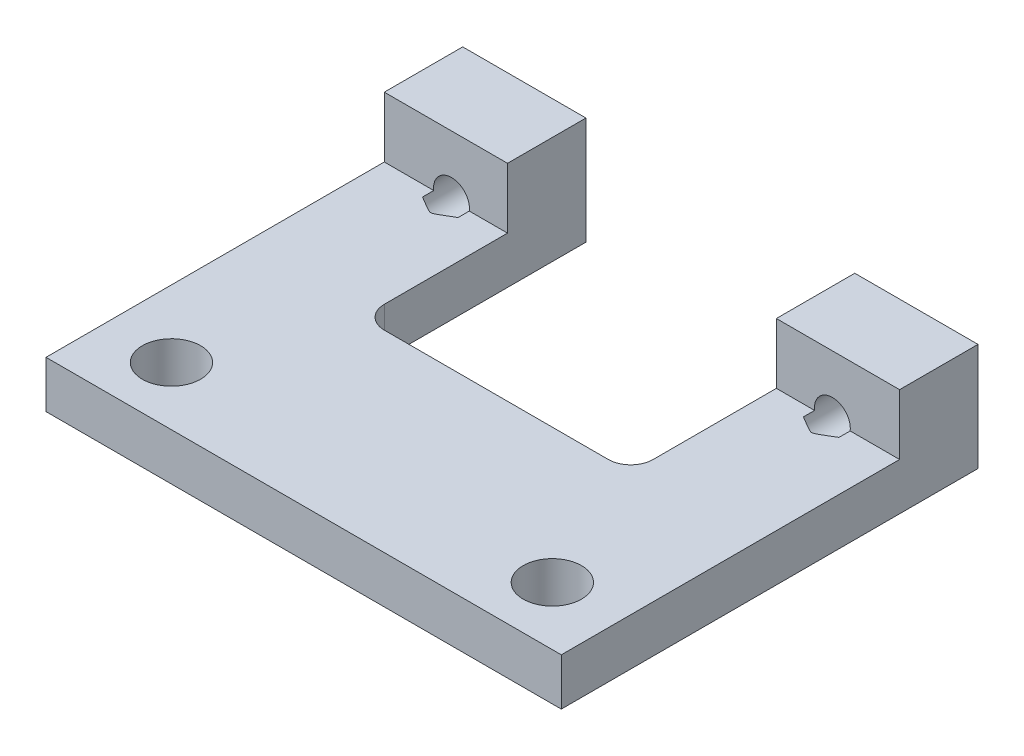
ISO-10303-21;
HEADER;
FILE_DESCRIPTION(('STEP AP214'),'2;1');
FILE_NAME('part.step','',(''),(''),'','','');
FILE_SCHEMA(('AUTOMOTIVE_DESIGN { 1 0 10303 214 1 1 1 1 }'));
ENDSEC;
DATA;
#1=APPLICATION_CONTEXT('core data for automotive mechanical design processes');
#2=APPLICATION_PROTOCOL_DEFINITION('international standard','automotive_design',2000,#1);
#3=PRODUCT_CONTEXT('',#1,'mechanical');
#4=PRODUCT('Part','Part','',(#3));
#5=PRODUCT_RELATED_PRODUCT_CATEGORY('part','',(#4));
#6=PRODUCT_DEFINITION_FORMATION('','',#4);
#7=PRODUCT_DEFINITION_CONTEXT('part definition',#1,'design');
#8=PRODUCT_DEFINITION('design','',#6,#7);
#9=PRODUCT_DEFINITION_SHAPE('','',#8);
#10=(LENGTH_UNIT() NAMED_UNIT(*) SI_UNIT(.MILLI.,.METRE.));
#11=(NAMED_UNIT(*) PLANE_ANGLE_UNIT() SI_UNIT($,.RADIAN.));
#12=(NAMED_UNIT(*) SI_UNIT($,.STERADIAN.) SOLID_ANGLE_UNIT());
#13=UNCERTAINTY_MEASURE_WITH_UNIT(LENGTH_MEASURE(1.E-05),#10,'distance_accuracy_value','');
#14=(GEOMETRIC_REPRESENTATION_CONTEXT(3) GLOBAL_UNCERTAINTY_ASSIGNED_CONTEXT((#13)) GLOBAL_UNIT_ASSIGNED_CONTEXT((#10,
#11,#12)) REPRESENTATION_CONTEXT('',''));
#15=CARTESIAN_POINT('',(0.,0.,0.));
#16=DIRECTION('',(0.,0.,1.));
#17=DIRECTION('',(1.,0.,0.));
#18=AXIS2_PLACEMENT_3D('',#15,#16,#17);
#19=CARTESIAN_POINT('',(-11.5,4.8,-9.3));
#20=DIRECTION('',(0.,0.,1.));
#21=DIRECTION('',(1.,0.,0.));
#22=AXIS2_PLACEMENT_3D('',#19,#20,#21);
#23=PLANE('',#22);
#24=CARTESIAN_POINT('',(-8.5,2.2,-9.3));
#25=DIRECTION('',(0.,0.,-1.));
#26=DIRECTION('',(-1.,0.,0.));
#27=AXIS2_PLACEMENT_3D('',#24,#25,#26);
#28=CIRCLE('',#27,0.799999999999999);
#29=CARTESIAN_POINT('',(-9.3,2.2,-9.3));
#30=VERTEX_POINT('',#29);
#31=EDGE_CURVE('E419',#30,#30,#28,.T.);
#32=ORIENTED_EDGE('',*,*,#31,.F.);
#33=EDGE_LOOP('',(#32));
#34=FACE_BOUND('',#33,.T.);
#35=DIRECTION('',(-1.,0.,0.));
#36=VECTOR('',#35,1.);
#37=CARTESIAN_POINT('',(-11.5,4.8,-9.3));
#38=LINE('',#37,#36);
#39=CARTESIAN_POINT('',(-5.99999999999998,4.8,-9.3));
#40=VERTEX_POINT('',#39);
#41=CARTESIAN_POINT('',(-11.5,4.8,-9.3));
#42=VERTEX_POINT('',#41);
#43=EDGE_CURVE('E298',#40,#42,#38,.T.);
#44=ORIENTED_EDGE('',*,*,#43,.F.);
#45=DIRECTION('',(0.,-1.,0.));
#46=VECTOR('',#45,1.);
#47=CARTESIAN_POINT('',(-5.99999999999998,27.8,-9.3));
#48=LINE('',#47,#46);
#49=CARTESIAN_POINT('',(-5.99999999999998,0.,-9.3));
#50=VERTEX_POINT('',#49);
#51=EDGE_CURVE('E248',#40,#50,#48,.T.);
#52=ORIENTED_EDGE('',*,*,#51,.T.);
#53=DIRECTION('',(-1.,0.,0.));
#54=VECTOR('',#53,1.);
#55=CARTESIAN_POINT('',(-11.5,0.,-9.3));
#56=LINE('',#55,#54);
#57=CARTESIAN_POINT('',(-11.5,0.,-9.3));
#58=VERTEX_POINT('',#57);
#59=EDGE_CURVE('E312',#50,#58,#56,.T.);
#60=ORIENTED_EDGE('',*,*,#59,.T.);
#61=DIRECTION('',(0.,-1.,0.));
#62=VECTOR('',#61,1.);
#63=CARTESIAN_POINT('',(-11.5,4.8,-9.3));
#64=LINE('',#63,#62);
#65=EDGE_CURVE('E329',#42,#58,#64,.T.);
#66=ORIENTED_EDGE('',*,*,#65,.F.);
#67=EDGE_LOOP('',(#44,#52,#60,#66));
#68=FACE_BOUND('',#67,.T.);
#69=ADVANCED_FACE('F47',(#34,#68),#23,.F.);
#70=CARTESIAN_POINT('',(11.5,4.8,9.3));
#71=DIRECTION('',(0.,1.,0.));
#72=DIRECTION('',(0.,0.,1.));
#73=AXIS2_PLACEMENT_3D('',#70,#71,#72);
#74=PLANE('',#73);
#75=DIRECTION('',(0.,0.,1.));
#76=VECTOR('',#75,1.);
#77=CARTESIAN_POINT('',(-5.99999999999998,4.8,9.3));
#78=LINE('',#77,#76);
#79=CARTESIAN_POINT('',(-5.99999999999998,4.8,-5.8));
#80=VERTEX_POINT('',#79);
#81=EDGE_CURVE('E261',#40,#80,#78,.T.);
#82=ORIENTED_EDGE('',*,*,#81,.F.);
#83=ORIENTED_EDGE('',*,*,#43,.T.);
#84=DIRECTION('',(0.,0.,1.));
#85=VECTOR('',#84,1.);
#86=CARTESIAN_POINT('',(-11.5,4.8,-9.3));
#87=LINE('',#86,#85);
#88=CARTESIAN_POINT('',(-11.5,4.8,-5.8));
#89=VERTEX_POINT('',#88);
#90=EDGE_CURVE('E304',#42,#89,#87,.T.);
#91=ORIENTED_EDGE('',*,*,#90,.T.);
#92=DIRECTION('',(-1.,0.,0.));
#93=VECTOR('',#92,1.);
#94=CARTESIAN_POINT('',(11.5,4.8,-5.80000000000001));
#95=LINE('',#94,#93);
#96=EDGE_CURVE('E337',#80,#89,#95,.T.);
#97=ORIENTED_EDGE('',*,*,#96,.F.);
#98=EDGE_LOOP('',(#82,#83,#91,#97));
#99=FACE_BOUND('',#98,.T.);
#100=ADVANCED_FACE('F378',(#99),#74,.T.);
#101=CARTESIAN_POINT('',(-16.3,4.8,-5.8));
#102=DIRECTION('',(0.,0.,-1.));
#103=DIRECTION('',(-1.,0.,0.));
#104=AXIS2_PLACEMENT_3D('',#101,#102,#103);
#105=PLANE('',#104);
#106=DIRECTION('',(1.,0.,0.));
#107=VECTOR('',#106,1.);
#108=CARTESIAN_POINT('',(-16.3,2.1,-5.8));
#109=LINE('',#108,#107);
#110=CARTESIAN_POINT('',(-11.5,2.1,-5.8));
#111=VERTEX_POINT('',#110);
#112=CARTESIAN_POINT('',(-9.29372539331938,2.1,-5.8));
#113=VERTEX_POINT('',#112);
#114=EDGE_CURVE('E278',#111,#113,#109,.T.);
#115=ORIENTED_EDGE('',*,*,#114,.T.);
#116=CARTESIAN_POINT('',(-8.5,2.2,-5.8));
#117=DIRECTION('',(0.,0.,-1.));
#118=DIRECTION('',(-1.,0.,0.));
#119=AXIS2_PLACEMENT_3D('',#116,#117,#118);
#120=CIRCLE('',#119,0.799999999999999);
#121=CARTESIAN_POINT('',(-7.70627460668062,2.1,-5.8));
#122=VERTEX_POINT('',#121);
#123=EDGE_CURVE('E457',#113,#122,#120,.T.);
#124=ORIENTED_EDGE('',*,*,#123,.T.);
#125=CARTESIAN_POINT('',(-5.99999999999998,2.1,-5.8));
#126=VERTEX_POINT('',#125);
#127=EDGE_CURVE('E283',#122,#126,#109,.T.);
#128=ORIENTED_EDGE('',*,*,#127,.T.);
#129=DIRECTION('',(0.,1.,0.));
#130=VECTOR('',#129,1.);
#131=CARTESIAN_POINT('',(-5.99999999999998,4.8,-5.8));
#132=LINE('',#131,#130);
#133=EDGE_CURVE('E257',#126,#80,#132,.T.);
#134=ORIENTED_EDGE('',*,*,#133,.T.);
#135=ORIENTED_EDGE('',*,*,#96,.T.);
#136=DIRECTION('',(0.,1.,0.));
#137=VECTOR('',#136,1.);
#138=CARTESIAN_POINT('',(-11.5,4.8,-5.8));
#139=LINE('',#138,#137);
#140=EDGE_CURVE('E282',#111,#89,#139,.T.);
#141=ORIENTED_EDGE('',*,*,#140,.F.);
#142=EDGE_LOOP('',(#115,#124,#128,#134,#135,#141));
#143=FACE_BOUND('',#142,.T.);
#144=ADVANCED_FACE('F395',(#143),#105,.F.);
#145=CARTESIAN_POINT('',(11.5,4.8,-9.3));
#146=DIRECTION('',(-1.,0.,0.));
#147=DIRECTION('',(0.,0.,1.));
#148=AXIS2_PLACEMENT_3D('',#145,#146,#147);
#149=PLANE('',#148);
#150=DIRECTION('',(0.,0.,-1.));
#151=VECTOR('',#150,1.);
#152=CARTESIAN_POINT('',(11.5,4.8,-9.3));
#153=LINE('',#152,#151);
#154=CARTESIAN_POINT('',(11.5,4.8,-5.80000000000001));
#155=VERTEX_POINT('',#154);
#156=CARTESIAN_POINT('',(11.5,4.8,-9.3));
#157=VERTEX_POINT('',#156);
#158=EDGE_CURVE('E295',#155,#157,#153,.T.);
#159=ORIENTED_EDGE('',*,*,#158,.F.);
#160=DIRECTION('',(0.,1.,0.));
#161=VECTOR('',#160,1.);
#162=CARTESIAN_POINT('',(11.5,4.8,-5.8));
#163=LINE('',#162,#161);
#164=CARTESIAN_POINT('',(11.5,2.1,-5.8));
#165=VERTEX_POINT('',#164);
#166=EDGE_CURVE('E274',#165,#155,#163,.T.);
#167=ORIENTED_EDGE('',*,*,#166,.F.);
#168=DIRECTION('',(0.,0.,-1.));
#169=VECTOR('',#168,1.);
#170=CARTESIAN_POINT('',(11.5,2.1,9.3));
#171=LINE('',#170,#169);
#172=CARTESIAN_POINT('',(11.5,2.1,9.3));
#173=VERTEX_POINT('',#172);
#174=EDGE_CURVE('E266',#173,#165,#171,.T.);
#175=ORIENTED_EDGE('',*,*,#174,.F.);
#176=DIRECTION('',(0.,-1.,0.));
#177=VECTOR('',#176,1.);
#178=CARTESIAN_POINT('',(11.5,4.8,9.3));
#179=LINE('',#178,#177);
#180=CARTESIAN_POINT('',(11.5,0.,9.3));
#181=VERTEX_POINT('',#180);
#182=EDGE_CURVE('E308',#173,#181,#179,.T.);
#183=ORIENTED_EDGE('',*,*,#182,.T.);
#184=DIRECTION('',(0.,0.,-1.));
#185=VECTOR('',#184,1.);
#186=CARTESIAN_POINT('',(11.5,0.,-9.3));
#187=LINE('',#186,#185);
#188=CARTESIAN_POINT('',(11.5,0.,-9.3));
#189=VERTEX_POINT('',#188);
#190=EDGE_CURVE('E294',#181,#189,#187,.T.);
#191=ORIENTED_EDGE('',*,*,#190,.T.);
#192=DIRECTION('',(0.,-1.,0.));
#193=VECTOR('',#192,1.);
#194=CARTESIAN_POINT('',(11.5,4.8,-9.3));
#195=LINE('',#194,#193);
#196=EDGE_CURVE('E333',#157,#189,#195,.T.);
#197=ORIENTED_EDGE('',*,*,#196,.F.);
#198=EDGE_LOOP('',(#159,#167,#175,#183,#191,#197));
#199=FACE_BOUND('',#198,.T.);
#200=ADVANCED_FACE('F392',(#199),#149,.F.);
#201=CARTESIAN_POINT('',(8.5,2.2,-9.3));
#202=DIRECTION('',(0.,0.,-1.));
#203=DIRECTION('',(-1.,0.,0.));
#204=AXIS2_PLACEMENT_3D('',#201,#202,#203);
#205=CIRCLE('',#204,0.8);
#206=CARTESIAN_POINT('',(7.7,2.2,-9.3));
#207=VERTEX_POINT('',#206);
#208=EDGE_CURVE('E188',#207,#207,#205,.T.);
#209=ORIENTED_EDGE('',*,*,#208,.F.);
#210=EDGE_LOOP('',(#209));
#211=FACE_BOUND('',#210,.T.);
#212=CARTESIAN_POINT('',(6.00000000000002,0.,-9.3));
#213=VERTEX_POINT('',#212);
#214=EDGE_CURVE('E313',#189,#213,#56,.T.);
#215=ORIENTED_EDGE('',*,*,#214,.T.);
#216=DIRECTION('',(0.,-1.,0.));
#217=VECTOR('',#216,1.);
#218=CARTESIAN_POINT('',(6.00000000000002,27.8,-9.3));
#219=LINE('',#218,#217);
#220=CARTESIAN_POINT('',(6.00000000000002,4.8,-9.3));
#221=VERTEX_POINT('',#220);
#222=EDGE_CURVE('E442',#221,#213,#219,.T.);
#223=ORIENTED_EDGE('',*,*,#222,.F.);
#224=EDGE_CURVE('E300',#157,#221,#38,.T.);
#225=ORIENTED_EDGE('',*,*,#224,.F.);
#226=ORIENTED_EDGE('',*,*,#196,.T.);
#227=EDGE_LOOP('',(#215,#223,#225,#226));
#228=FACE_BOUND('',#227,.T.);
#229=ADVANCED_FACE('F388',(#211,#228),#23,.F.);
#230=CARTESIAN_POINT('',(-11.5,4.8,-9.3));
#231=DIRECTION('',(1.,0.,0.));
#232=DIRECTION('',(0.,0.,-1.));
#233=AXIS2_PLACEMENT_3D('',#230,#231,#232);
#234=PLANE('',#233);
#235=DIRECTION('',(0.,0.,-1.));
#236=VECTOR('',#235,1.);
#237=CARTESIAN_POINT('',(-11.5,2.1,-9.3));
#238=LINE('',#237,#236);
#239=CARTESIAN_POINT('',(-11.5,2.1,9.3));
#240=VERTEX_POINT('',#239);
#241=EDGE_CURVE('E290',#240,#111,#238,.T.);
#242=ORIENTED_EDGE('',*,*,#241,.T.);
#243=ORIENTED_EDGE('',*,*,#140,.T.);
#244=ORIENTED_EDGE('',*,*,#90,.F.);
#245=ORIENTED_EDGE('',*,*,#65,.T.);
#246=DIRECTION('',(0.,0.,1.));
#247=VECTOR('',#246,1.);
#248=CARTESIAN_POINT('',(-11.5,0.,-9.3));
#249=LINE('',#248,#247);
#250=CARTESIAN_POINT('',(-11.5,0.,9.3));
#251=VERTEX_POINT('',#250);
#252=EDGE_CURVE('E317',#58,#251,#249,.T.);
#253=ORIENTED_EDGE('',*,*,#252,.T.);
#254=DIRECTION('',(0.,-1.,0.));
#255=VECTOR('',#254,1.);
#256=CARTESIAN_POINT('',(-11.5,4.8,9.3));
#257=LINE('',#256,#255);
#258=EDGE_CURVE('E326',#240,#251,#257,.T.);
#259=ORIENTED_EDGE('',*,*,#258,.F.);
#260=EDGE_LOOP('',(#242,#243,#244,#245,#253,#259));
#261=FACE_BOUND('',#260,.T.);
#262=ADVANCED_FACE('F384',(#261),#234,.F.);
#263=CARTESIAN_POINT('',(-11.5,4.8,9.3));
#264=DIRECTION('',(0.,0.,-1.));
#265=DIRECTION('',(-1.,0.,0.));
#266=AXIS2_PLACEMENT_3D('',#263,#264,#265);
#267=PLANE('',#266);
#268=ORIENTED_EDGE('',*,*,#182,.F.);
#269=DIRECTION('',(1.,0.,0.));
#270=VECTOR('',#269,1.);
#271=CARTESIAN_POINT('',(-16.3,2.1,9.3));
#272=LINE('',#271,#270);
#273=EDGE_CURVE('E277',#240,#173,#272,.T.);
#274=ORIENTED_EDGE('',*,*,#273,.F.);
#275=ORIENTED_EDGE('',*,*,#258,.T.);
#276=DIRECTION('',(1.,0.,0.));
#277=VECTOR('',#276,1.);
#278=CARTESIAN_POINT('',(-11.5,0.,9.3));
#279=LINE('',#278,#277);
#280=EDGE_CURVE('E299',#251,#181,#279,.T.);
#281=ORIENTED_EDGE('',*,*,#280,.T.);
#282=EDGE_LOOP('',(#268,#274,#275,#281));
#283=FACE_BOUND('',#282,.T.);
#284=ADVANCED_FACE('F376',(#283),#267,.F.);
#285=DIRECTION('',(0.,0.,-1.));
#286=VECTOR('',#285,1.);
#287=CARTESIAN_POINT('',(6.00000000000002,4.8,9.3));
#288=LINE('',#287,#286);
#289=CARTESIAN_POINT('',(6.00000000000002,4.8,-5.8));
#290=VERTEX_POINT('',#289);
#291=EDGE_CURVE('E262',#290,#221,#288,.T.);
#292=ORIENTED_EDGE('',*,*,#291,.F.);
#293=EDGE_CURVE('E338',#155,#290,#95,.T.);
#294=ORIENTED_EDGE('',*,*,#293,.F.);
#295=ORIENTED_EDGE('',*,*,#158,.T.);
#296=ORIENTED_EDGE('',*,*,#224,.T.);
#297=EDGE_LOOP('',(#292,#294,#295,#296));
#298=FACE_BOUND('',#297,.T.);
#299=ADVANCED_FACE('F372',(#298),#74,.T.);
#300=CARTESIAN_POINT('',(11.5,0.,9.3));
#301=DIRECTION('',(0.,1.,0.));
#302=DIRECTION('',(0.,0.,1.));
#303=AXIS2_PLACEMENT_3D('',#300,#301,#302);
#304=PLANE('',#303);
#305=CARTESIAN_POINT('',(8.5,0.,6.7));
#306=DIRECTION('',(0.,-1.,0.));
#307=DIRECTION('',(0.,0.,-1.));
#308=AXIS2_PLACEMENT_3D('',#305,#306,#307);
#309=CIRCLE('',#308,1.3);
#310=CARTESIAN_POINT('',(8.5,0.,5.4));
#311=VERTEX_POINT('',#310);
#312=EDGE_CURVE('E216',#311,#311,#309,.T.);
#313=ORIENTED_EDGE('',*,*,#312,.F.);
#314=EDGE_LOOP('',(#313));
#315=FACE_BOUND('',#314,.T.);
#316=CARTESIAN_POINT('',(-8.5,0.,6.7));
#317=DIRECTION('',(0.,-1.,0.));
#318=DIRECTION('',(0.,0.,-1.));
#319=AXIS2_PLACEMENT_3D('',#316,#317,#318);
#320=CIRCLE('',#319,1.3);
#321=CARTESIAN_POINT('',(-8.5,0.,5.4));
#322=VERTEX_POINT('',#321);
#323=EDGE_CURVE('E211',#322,#322,#320,.T.);
#324=ORIENTED_EDGE('',*,*,#323,.F.);
#325=EDGE_LOOP('',(#324));
#326=FACE_BOUND('',#325,.T.);
#327=ORIENTED_EDGE('',*,*,#59,.F.);
#328=DIRECTION('',(0.,0.,-1.));
#329=VECTOR('',#328,1.);
#330=CARTESIAN_POINT('',(-5.99999999999998,0.,-9.3));
#331=LINE('',#330,#329);
#332=CARTESIAN_POINT('',(-5.99999999999998,0.,-0.300000000000003));
#333=VERTEX_POINT('',#332);
#334=EDGE_CURVE('E242',#333,#50,#331,.T.);
#335=ORIENTED_EDGE('',*,*,#334,.F.);
#336=CARTESIAN_POINT('',(-4.99999999999998,0.,-0.300000000000003));
#337=DIRECTION('',(0.,1.,0.));
#338=DIRECTION('',(0.,0.,1.));
#339=AXIS2_PLACEMENT_3D('',#336,#337,#338);
#340=CIRCLE('',#339,1.);
#341=CARTESIAN_POINT('',(-4.99999999999998,0.,0.699999999999997));
#342=VERTEX_POINT('',#341);
#343=EDGE_CURVE('E56',#333,#342,#340,.T.);
#344=ORIENTED_EDGE('',*,*,#343,.T.);
#345=DIRECTION('',(-1.,0.,0.));
#346=VECTOR('',#345,1.);
#347=CARTESIAN_POINT('',(-5.99999999999998,0.,0.699999999999997));
#348=LINE('',#347,#346);
#349=CARTESIAN_POINT('',(5.00000000000002,0.,0.699999999999997));
#350=VERTEX_POINT('',#349);
#351=EDGE_CURVE('E241',#350,#342,#348,.T.);
#352=ORIENTED_EDGE('',*,*,#351,.F.);
#353=CARTESIAN_POINT('',(5.00000000000002,0.,-0.300000000000003));
#354=DIRECTION('',(0.,1.,0.));
#355=DIRECTION('',(0.,0.,1.));
#356=AXIS2_PLACEMENT_3D('',#353,#354,#355);
#357=CIRCLE('',#356,1.);
#358=CARTESIAN_POINT('',(6.00000000000002,0.,-0.300000000000003));
#359=VERTEX_POINT('',#358);
#360=EDGE_CURVE('E229',#350,#359,#357,.T.);
#361=ORIENTED_EDGE('',*,*,#360,.T.);
#362=DIRECTION('',(0.,0.,1.));
#363=VECTOR('',#362,1.);
#364=CARTESIAN_POINT('',(6.00000000000002,0.,-9.3));
#365=LINE('',#364,#363);
#366=EDGE_CURVE('E249',#213,#359,#365,.T.);
#367=ORIENTED_EDGE('',*,*,#366,.F.);
#368=ORIENTED_EDGE('',*,*,#214,.F.);
#369=ORIENTED_EDGE('',*,*,#190,.F.);
#370=ORIENTED_EDGE('',*,*,#280,.F.);
#371=ORIENTED_EDGE('',*,*,#252,.F.);
#372=EDGE_LOOP('',(#327,#335,#344,#352,#361,#367,#368,#369,#370,#371));
#373=FACE_BOUND('',#372,.T.);
#374=ADVANCED_FACE('F240',(#315,#326,#373),#304,.F.);
#375=CARTESIAN_POINT('',(-16.3,2.1,9.3));
#376=DIRECTION('',(0.,-1.,0.));
#377=DIRECTION('',(0.,0.,-1.));
#378=AXIS2_PLACEMENT_3D('',#375,#376,#377);
#379=PLANE('',#378);
#380=CARTESIAN_POINT('',(8.5,2.1,6.7));
#381=DIRECTION('',(0.,-1.,0.));
#382=DIRECTION('',(0.,0.,-1.));
#383=AXIS2_PLACEMENT_3D('',#380,#381,#382);
#384=CIRCLE('',#383,1.3);
#385=CARTESIAN_POINT('',(8.5,2.1,5.4));
#386=VERTEX_POINT('',#385);
#387=EDGE_CURVE('E212',#386,#386,#384,.T.);
#388=ORIENTED_EDGE('',*,*,#387,.T.);
#389=EDGE_LOOP('',(#388));
#390=FACE_BOUND('',#389,.T.);
#391=CARTESIAN_POINT('',(-8.5,2.1,6.7));
#392=DIRECTION('',(0.,-1.,0.));
#393=DIRECTION('',(0.,0.,-1.));
#394=AXIS2_PLACEMENT_3D('',#391,#392,#393);
#395=CIRCLE('',#394,1.3);
#396=CARTESIAN_POINT('',(-8.5,2.1,5.4));
#397=VERTEX_POINT('',#396);
#398=EDGE_CURVE('E207',#397,#397,#395,.T.);
#399=ORIENTED_EDGE('',*,*,#398,.T.);
#400=EDGE_LOOP('',(#399));
#401=FACE_BOUND('',#400,.T.);
#402=CARTESIAN_POINT('',(4.43891567490098,2.1,-7.26019681273014));
#403=CARTESIAN_POINT('',(4.72130694274858,2.1,-7.09057880220545));
#404=CARTESIAN_POINT('',(5.00369652765075,2.1,-6.92095795822086));
#405=CARTESIAN_POINT('',(5.5684996830373,2.1,-6.58174833020258));
#406=CARTESIAN_POINT('',(5.85091325377424,2.1,-6.41215954658944));
#407=CARTESIAN_POINT('',(6.27451073717776,2.1,-6.15786555993118));
#408=CARTESIAN_POINT('',(6.41567800179443,2.1,-6.07313261212846));
#409=CARTESIAN_POINT('',(6.69803219648535,2.1,-5.90369905569777));
#410=CARTESIAN_POINT('',(6.83921912658216,2.1,-5.81899844710732));
#411=CARTESIAN_POINT('',(7.12163814546575,2.1,-5.64967561665425));
#412=CARTESIAN_POINT('',(7.26287023383697,2.1,-5.5650533940967));
#413=CARTESIAN_POINT('',(7.54542061531657,2.1,-5.39595299786062));
#414=CARTESIAN_POINT('',(7.68673890818257,2.1,-5.31147482377956));
#415=CARTESIAN_POINT('',(7.88310021429967,2.1,-5.1947949038215));
#416=CARTESIAN_POINT('',(7.93795447247318,2.1,-5.16227575051703));
#417=CARTESIAN_POINT('',(8.0478225666439,2.1,-5.09748958124891));
#418=CARTESIAN_POINT('',(8.10283642358729,2.1,-5.06522260064361));
#419=CARTESIAN_POINT('',(8.18703659904506,2.1,-5.01666503364856));
#420=CARTESIAN_POINT('',(8.21605190337322,2.1,-5.0000806641138));
#421=CARTESIAN_POINT('',(8.25980169751843,2.1,-4.97561347406384));
#422=CARTESIAN_POINT('',(8.27442185252393,2.1,-4.96752646147047));
#423=CARTESIAN_POINT('',(8.30378646062642,2.1,-4.95158213834066));
#424=CARTESIAN_POINT('',(8.31853089775956,2.1,-4.94372479886532));
#425=CARTESIAN_POINT('',(8.34958862339694,2.1,-4.92772225280617));
#426=CARTESIAN_POINT('',(8.3659220537344,2.1,-4.91961645327956));
#427=CARTESIAN_POINT('',(8.39912892348519,2.1,-4.90440007029616));
#428=CARTESIAN_POINT('',(8.41600348194479,2.1,-4.89729173776439));
#429=CARTESIAN_POINT('',(8.44415724482852,2.1,-4.887924748074));
#430=CARTESIAN_POINT('',(8.45514570618679,2.1,-4.88484819463181));
#431=CARTESIAN_POINT('',(8.47741268782298,2.1,-4.88059527123392));
#432=CARTESIAN_POINT('',(8.48868703893474,2.1,-4.87939959964523));
#433=CARTESIAN_POINT('',(8.51130379494682,2.1,-4.87939553041761));
#434=CARTESIAN_POINT('',(8.52264620118611,2.1,-4.88060153890255));
#435=CARTESIAN_POINT('',(8.54505490654184,2.1,-4.88489180426887));
#436=CARTESIAN_POINT('',(8.5561166655234,2.1,-4.88799703325692));
#437=CARTESIAN_POINT('',(8.57801375635179,2.1,-4.89532110083856));
#438=CARTESIAN_POINT('',(8.5888437297896,2.1,-4.89955496022516));
#439=CARTESIAN_POINT('',(8.61024944745873,2.1,-4.90863225091213));
#440=CARTESIAN_POINT('',(8.62082495988385,2.1,-4.91347621469113));
#441=CARTESIAN_POINT('',(8.65236430436239,2.1,-4.92854290613603));
#442=CARTESIAN_POINT('',(8.67308023638934,2.1,-4.93927610880845));
#443=CARTESIAN_POINT('',(8.71429811876336,2.1,-4.9612987241079));
#444=CARTESIAN_POINT('',(8.7347990587598,2.1,-4.97258996221496));
#445=CARTESIAN_POINT('',(8.77561126910932,2.1,-4.99542235034713));
#446=CARTESIAN_POINT('',(8.79592282426965,2.1,-5.00696298884408));
#447=CARTESIAN_POINT('',(8.85628220863301,2.1,-5.04153912060572));
#448=CARTESIAN_POINT('',(8.8962106398252,2.1,-5.0647815832309));
#449=CARTESIAN_POINT('',(8.97594067980317,2.1,-5.11148509017451));
#450=CARTESIAN_POINT('',(9.01574228425744,2.1,-5.13494614185325));
#451=CARTESIAN_POINT('',(9.13511028179008,2.1,-5.20552803820486));
#452=CARTESIAN_POINT('',(9.21457981776594,2.1,-5.25281256460566));
#453=CARTESIAN_POINT('',(9.37302571211895,2.1,-5.34727966065023));
#454=CARTESIAN_POINT('',(9.45200250509041,2.1,-5.39446150418216));
#455=CARTESIAN_POINT('',(9.60989249300685,2.1,-5.48888760233075));
#456=CARTESIAN_POINT('',(9.68880569880603,2.1,-5.536131838779));
#457=CARTESIAN_POINT('',(9.99676563366586,2.1,-5.72059670166107));
#458=CARTESIAN_POINT('',(10.2257338350694,2.1,-5.85794832883232));
#459=CARTESIAN_POINT('',(10.6836494745034,2.1,-6.13274108856508));
#460=CARTESIAN_POINT('',(10.9125969077679,2.1,-6.27018222906435));
#461=CARTESIAN_POINT('',(11.3728485869108,2.1,-6.54652965183054));
#462=CARTESIAN_POINT('',(11.6041526021023,2.1,-6.68543631834632));
#463=CARTESIAN_POINT('',(12.0667239123216,2.1,-6.96325472264666));
#464=CARTESIAN_POINT('',(12.2979912086303,2.1,-7.10216645829841));
#465=CARTESIAN_POINT('',(12.5292578057135,2.1,-7.24107935131653));
#466=B_SPLINE_CURVE_WITH_KNOTS('',3,(#402,#403,#404,#405,#406,#407,#408,#409,#410,#411,#412,
#413,#414,#415,#416,#417,#418,#419,#420,#421,#422,#423,#424,#425,#426,#427,#428,#429,#430,#431,
#432,#433,#434,#435,#436,#437,#438,#439,#440,#441,#442,#443,#444,#445,#446,#447,#448,#449,#450,
#451,#452,#453,#454,#455,#456,#457,#458,#459,#460,#461,#462,#463,#464,#465),.UNSPECIFIED.,.F.,
.F.,(4,2,2,2,2,2,2,2,2,2,2,2,2,2,2,2,2,2,2,2,2,2,2,2,2,2,2,2,2,2,2,4),(0.,0.988248926336891,
1.97651002278304,2.4704440635906,2.96437867548994,3.45830886566029,3.95223767332867,
4.143544545844,4.3348777777579,4.43513565013561,4.4852583544512,4.53537471582472,
4.59007512402772,4.64489705183489,4.67903706670843,4.71282439602242,4.74681500411478,
4.78118790459479,4.81604332765566,4.85092938493907,4.92089719624401,4.99111138299272,
5.06119313824733,5.19979309819708,5.33839774206426,5.6158156100094,5.89180687771774,
6.16773038044994,6.96874664817433,7.76984773680238,8.57927313786534,9.38861193418752),.UNSPECIFIED.);
#467=CARTESIAN_POINT('',(9.29372539331938,2.1,-5.3));
#468=VERTEX_POINT('',#467);
#469=CARTESIAN_POINT('',(7.70627460668062,2.1,-5.3));
#470=VERTEX_POINT('',#469);
#471=EDGE_CURVE('E171',#468,#470,#466,.F.);
#472=ORIENTED_EDGE('',*,*,#471,.T.);
#473=DIRECTION('',(0.,0.,-1.));
#474=VECTOR('',#473,1.);
#475=CARTESIAN_POINT('',(7.70627460668062,2.1,-9.3));
#476=LINE('',#475,#474);
#477=CARTESIAN_POINT('',(7.70627460668062,2.1,-5.8));
#478=VERTEX_POINT('',#477);
#479=EDGE_CURVE('E185',#470,#478,#476,.T.);
#480=ORIENTED_EDGE('',*,*,#479,.T.);
#481=CARTESIAN_POINT('',(6.00000000000002,2.1,-5.8));
#482=VERTEX_POINT('',#481);
#483=EDGE_CURVE('E284',#482,#478,#109,.T.);
#484=ORIENTED_EDGE('',*,*,#483,.F.);
#485=DIRECTION('',(0.,0.,1.));
#486=VECTOR('',#485,1.);
#487=CARTESIAN_POINT('',(6.00000000000002,2.1,9.3));
#488=LINE('',#487,#486);
#489=CARTESIAN_POINT('',(6.00000000000002,2.1,-0.300000000000003));
#490=VERTEX_POINT('',#489);
#491=EDGE_CURVE('E268',#482,#490,#488,.T.);
#492=ORIENTED_EDGE('',*,*,#491,.T.);
#493=CARTESIAN_POINT('',(5.00000000000002,2.1,-0.300000000000003));
#494=DIRECTION('',(0.,-1.,0.));
#495=DIRECTION('',(0.,0.,-1.));
#496=AXIS2_PLACEMENT_3D('',#493,#494,#495);
#497=CIRCLE('',#496,1.);
#498=CARTESIAN_POINT('',(5.00000000000002,2.1,0.699999999999997));
#499=VERTEX_POINT('',#498);
#500=EDGE_CURVE('E232',#490,#499,#497,.T.);
#501=ORIENTED_EDGE('',*,*,#500,.T.);
#502=DIRECTION('',(-1.,0.,0.));
#503=VECTOR('',#502,1.);
#504=CARTESIAN_POINT('',(-16.3,2.1,0.699999999999996));
#505=LINE('',#504,#503);
#506=CARTESIAN_POINT('',(-4.99999999999998,2.1,0.699999999999997));
#507=VERTEX_POINT('',#506);
#508=EDGE_CURVE('E348',#499,#507,#505,.T.);
#509=ORIENTED_EDGE('',*,*,#508,.T.);
#510=CARTESIAN_POINT('',(-4.99999999999998,2.1,-0.300000000000003));
#511=DIRECTION('',(0.,-1.,0.));
#512=DIRECTION('',(0.,0.,-1.));
#513=AXIS2_PLACEMENT_3D('',#510,#511,#512);
#514=CIRCLE('',#513,1.);
#515=CARTESIAN_POINT('',(-5.99999999999998,2.1,-0.300000000000003));
#516=VERTEX_POINT('',#515);
#517=EDGE_CURVE('E11',#507,#516,#514,.T.);
#518=ORIENTED_EDGE('',*,*,#517,.T.);
#519=DIRECTION('',(0.,0.,-1.));
#520=VECTOR('',#519,1.);
#521=CARTESIAN_POINT('',(-5.99999999999998,2.1,9.3));
#522=LINE('',#521,#520);
#523=EDGE_CURVE('E255',#516,#126,#522,.T.);
#524=ORIENTED_EDGE('',*,*,#523,.T.);
#525=ORIENTED_EDGE('',*,*,#127,.F.);
#526=DIRECTION('',(0.,0.,-1.));
#527=VECTOR('',#526,1.);
#528=CARTESIAN_POINT('',(-7.70627460668062,2.1,-9.3));
#529=LINE('',#528,#527);
#530=CARTESIAN_POINT('',(-7.70627460668063,2.1,-5.3));
#531=VERTEX_POINT('',#530);
#532=EDGE_CURVE('E360',#122,#531,#529,.F.);
#533=ORIENTED_EDGE('',*,*,#532,.T.);
#534=CARTESIAN_POINT('',(-12.561084325099,2.1,-7.26019681273014));
#535=CARTESIAN_POINT('',(-12.2786930572514,2.1,-7.09057880220545));
#536=CARTESIAN_POINT('',(-11.9963034723493,2.1,-6.92095795822086));
#537=CARTESIAN_POINT('',(-11.4315003169627,2.1,-6.58174833020258));
#538=CARTESIAN_POINT('',(-11.1490867462258,2.1,-6.41215954658944));
#539=CARTESIAN_POINT('',(-10.7254892628222,2.1,-6.15786555993118));
#540=CARTESIAN_POINT('',(-10.5843219982056,2.1,-6.07313261212846));
#541=CARTESIAN_POINT('',(-10.3019678035146,2.1,-5.90369905569777));
#542=CARTESIAN_POINT('',(-10.1607808734178,2.1,-5.81899844710732));
#543=CARTESIAN_POINT('',(-9.87836185453424,2.1,-5.64967561665425));
#544=CARTESIAN_POINT('',(-9.73712976616303,2.1,-5.5650533940967));
#545=CARTESIAN_POINT('',(-9.45457938468343,2.1,-5.39595299786062));
#546=CARTESIAN_POINT('',(-9.31326109181743,2.1,-5.31147482377956));
#547=CARTESIAN_POINT('',(-9.11689978570033,2.1,-5.1947949038215));
#548=CARTESIAN_POINT('',(-9.06204552752682,2.1,-5.16227575051703));
#549=CARTESIAN_POINT('',(-8.9521774333561,2.1,-5.09748958124891));
#550=CARTESIAN_POINT('',(-8.89716357641272,2.1,-5.06522260064361));
#551=CARTESIAN_POINT('',(-8.81296340095494,2.1,-5.01666503364856));
#552=CARTESIAN_POINT('',(-8.78394809662678,2.1,-5.0000806641138));
#553=CARTESIAN_POINT('',(-8.74019830248157,2.1,-4.97561347406384));
#554=CARTESIAN_POINT('',(-8.72557814747607,2.1,-4.96752646147048));
#555=CARTESIAN_POINT('',(-8.69621353937358,2.1,-4.95158213834066));
#556=CARTESIAN_POINT('',(-8.68146910224044,2.1,-4.94372479886532));
#557=CARTESIAN_POINT('',(-8.65041137660307,2.1,-4.92772225280617));
#558=CARTESIAN_POINT('',(-8.6340779462656,2.1,-4.91961645327957));
#559=CARTESIAN_POINT('',(-8.60087107651482,2.1,-4.90440007029616));
#560=CARTESIAN_POINT('',(-8.58399651805521,2.1,-4.89729173776439));
#561=CARTESIAN_POINT('',(-8.55584275517148,2.1,-4.887924748074));
#562=CARTESIAN_POINT('',(-8.54485429381321,2.1,-4.88484819463181));
#563=CARTESIAN_POINT('',(-8.52258731217702,2.1,-4.88059527123392));
#564=CARTESIAN_POINT('',(-8.51131296106526,2.1,-4.87939959964523));
#565=CARTESIAN_POINT('',(-8.48869620505318,2.1,-4.87939553041761));
#566=CARTESIAN_POINT('',(-8.47735379881389,2.1,-4.88060153890255));
#567=CARTESIAN_POINT('',(-8.45494509345816,2.1,-4.88489180426888));
#568=CARTESIAN_POINT('',(-8.4438833344766,2.1,-4.88799703325693));
#569=CARTESIAN_POINT('',(-8.42198624364821,2.1,-4.89532110083857));
#570=CARTESIAN_POINT('',(-8.4111562702104,2.1,-4.89955496022517));
#571=CARTESIAN_POINT('',(-8.38975055254127,2.1,-4.90863225091213));
#572=CARTESIAN_POINT('',(-8.37917504011615,2.1,-4.91347621469113));
#573=CARTESIAN_POINT('',(-8.3476356956376,2.1,-4.92854290613604));
#574=CARTESIAN_POINT('',(-8.32691976361065,2.1,-4.93927610880845));
#575=CARTESIAN_POINT('',(-8.28570188123663,2.1,-4.96129872410791));
#576=CARTESIAN_POINT('',(-8.26520094124019,2.1,-4.97258996221497));
#577=CARTESIAN_POINT('',(-8.22438873089066,2.1,-4.99542235034714));
#578=CARTESIAN_POINT('',(-8.20407717573033,2.1,-5.00696298884409));
#579=CARTESIAN_POINT('',(-8.14371779136696,2.1,-5.04153912060574));
#580=CARTESIAN_POINT('',(-8.10378936017477,2.1,-5.06478158323092));
#581=CARTESIAN_POINT('',(-8.0240593201968,2.1,-5.11148509017453));
#582=CARTESIAN_POINT('',(-7.98425771574252,2.1,-5.13494614185327));
#583=CARTESIAN_POINT('',(-7.86488971820988,2.1,-5.20552803820489));
#584=CARTESIAN_POINT('',(-7.78542018223401,2.1,-5.25281256460569));
#585=CARTESIAN_POINT('',(-7.62697428788098,2.1,-5.34727966065027));
#586=CARTESIAN_POINT('',(-7.54799749490952,2.1,-5.3944615041822));
#587=CARTESIAN_POINT('',(-7.39010750699307,2.1,-5.4888876023308));
#588=CARTESIAN_POINT('',(-7.31119430119388,2.1,-5.53613183877906));
#589=CARTESIAN_POINT('',(-7.00323436633404,2.1,-5.72059670166113));
#590=CARTESIAN_POINT('',(-6.77426616493052,2.1,-5.85794832883237));
#591=CARTESIAN_POINT('',(-6.31635052549648,2.1,-6.13274108856514));
#592=CARTESIAN_POINT('',(-6.08740309223205,2.1,-6.27018222906441));
#593=CARTESIAN_POINT('',(-5.62715141308911,2.1,-6.5465296518306));
#594=CARTESIAN_POINT('',(-5.39584739789758,2.1,-6.68543631834638));
#595=CARTESIAN_POINT('',(-4.93327608767829,2.1,-6.96325472264672));
#596=CARTESIAN_POINT('',(-4.70200879136962,2.1,-7.10216645829847));
#597=CARTESIAN_POINT('',(-4.47074219428637,2.1,-7.24107935131659));
#598=B_SPLINE_CURVE_WITH_KNOTS('',3,(#534,#535,#536,#537,#538,#539,#540,#541,#542,#543,#544,
#545,#546,#547,#548,#549,#550,#551,#552,#553,#554,#555,#556,#557,#558,#559,#560,#561,#562,#563,
#564,#565,#566,#567,#568,#569,#570,#571,#572,#573,#574,#575,#576,#577,#578,#579,#580,#581,#582,
#583,#584,#585,#586,#587,#588,#589,#590,#591,#592,#593,#594,#595,#596,#597),.UNSPECIFIED.,.F.,
.F.,(4,2,2,2,2,2,2,2,2,2,2,2,2,2,2,2,2,2,2,2,2,2,2,2,2,2,2,2,2,2,2,4),(0.,0.988248926336892,
1.97651002278304,2.4704440635906,2.96437867548994,3.45830886566029,3.95223767332867,
4.14354454584399,4.3348777777579,4.43513565013561,4.4852583544512,4.53537471582472,
4.59007512402771,4.64489705183488,4.67903706670843,4.71282439602242,4.74681500411478,
4.78118790459479,4.81604332765567,4.85092938493907,4.92089719624403,4.99111138299274,
5.06119313824736,5.19979309819712,5.33839774206431,5.61581561000947,5.89180687771782,
6.16773038045005,6.96874664817444,7.76984773680249,8.57927313786544,9.38861193418762),.UNSPECIFIED.);
#599=CARTESIAN_POINT('',(-9.29372539331938,2.1,-5.3));
#600=VERTEX_POINT('',#599);
#601=EDGE_CURVE('E351',#531,#600,#598,.F.);
#602=ORIENTED_EDGE('',*,*,#601,.T.);
#603=DIRECTION('',(0.,0.,-1.));
#604=VECTOR('',#603,1.);
#605=CARTESIAN_POINT('',(-9.29372539331938,2.1,-9.3));
#606=LINE('',#605,#604);
#607=EDGE_CURVE('E180',#600,#113,#606,.T.);
#608=ORIENTED_EDGE('',*,*,#607,.T.);
#609=ORIENTED_EDGE('',*,*,#114,.F.);
#610=ORIENTED_EDGE('',*,*,#241,.F.);
#611=ORIENTED_EDGE('',*,*,#273,.T.);
#612=ORIENTED_EDGE('',*,*,#174,.T.);
#613=CARTESIAN_POINT('',(9.29372539331938,2.1,-5.8));
#614=VERTEX_POINT('',#613);
#615=EDGE_CURVE('E193',#614,#165,#109,.T.);
#616=ORIENTED_EDGE('',*,*,#615,.F.);
#617=DIRECTION('',(0.,0.,-1.));
#618=VECTOR('',#617,1.);
#619=CARTESIAN_POINT('',(9.29372539331938,2.1,-9.3));
#620=LINE('',#619,#618);
#621=EDGE_CURVE('E179',#614,#468,#620,.F.);
#622=ORIENTED_EDGE('',*,*,#621,.T.);
#623=EDGE_LOOP('',(#472,#480,#484,#492,#501,#509,#518,#524,#525,#533,#602,#608,#609,#610,#611,
#612,#616,#622));
#624=FACE_BOUND('',#623,.T.);
#625=ADVANCED_FACE('F191',(#390,#401,#624),#379,.F.);
#626=ORIENTED_EDGE('',*,*,#483,.T.);
#627=CARTESIAN_POINT('',(8.5,2.2,-5.8));
#628=DIRECTION('',(0.,0.,-1.));
#629=DIRECTION('',(-1.,0.,0.));
#630=AXIS2_PLACEMENT_3D('',#627,#628,#629);
#631=CIRCLE('',#630,0.799999999999999);
#632=EDGE_CURVE('E187',#478,#614,#631,.T.);
#633=ORIENTED_EDGE('',*,*,#632,.T.);
#634=ORIENTED_EDGE('',*,*,#615,.T.);
#635=ORIENTED_EDGE('',*,*,#166,.T.);
#636=ORIENTED_EDGE('',*,*,#293,.T.);
#637=DIRECTION('',(0.,-1.,0.));
#638=VECTOR('',#637,1.);
#639=CARTESIAN_POINT('',(6.00000000000002,4.8,-5.8));
#640=LINE('',#639,#638);
#641=EDGE_CURVE('E342',#290,#482,#640,.T.);
#642=ORIENTED_EDGE('',*,*,#641,.T.);
#643=EDGE_LOOP('',(#626,#633,#634,#635,#636,#642));
#644=FACE_BOUND('',#643,.T.);
#645=ADVANCED_FACE('F369',(#644),#105,.F.);
#646=CARTESIAN_POINT('',(-5.99999999999998,27.8,0.699999999999997));
#647=DIRECTION('',(0.,0.,1.));
#648=DIRECTION('',(1.,0.,0.));
#649=AXIS2_PLACEMENT_3D('',#646,#647,#648);
#650=PLANE('',#649);
#651=ORIENTED_EDGE('',*,*,#508,.F.);
#652=DIRECTION('',(0.,-1.,0.));
#653=VECTOR('',#652,1.);
#654=CARTESIAN_POINT('',(5.00000000000002,0.,0.699999999999997));
#655=LINE('',#654,#653);
#656=EDGE_CURVE('E219',#499,#350,#655,.T.);
#657=ORIENTED_EDGE('',*,*,#656,.T.);
#658=ORIENTED_EDGE('',*,*,#351,.T.);
#659=DIRECTION('',(0.,-1.,0.));
#660=VECTOR('',#659,1.);
#661=CARTESIAN_POINT('',(-4.99999999999998,2.1,0.699999999999997));
#662=LINE('',#661,#660);
#663=EDGE_CURVE('E197',#342,#507,#662,.F.);
#664=ORIENTED_EDGE('',*,*,#663,.T.);
#665=EDGE_LOOP('',(#651,#657,#658,#664));
#666=FACE_BOUND('',#665,.T.);
#667=ADVANCED_FACE('F245',(#666),#650,.F.);
#668=CARTESIAN_POINT('',(-5.99999999999998,27.8,-9.3));
#669=DIRECTION('',(-1.,0.,0.));
#670=DIRECTION('',(0.,0.,1.));
#671=AXIS2_PLACEMENT_3D('',#668,#669,#670);
#672=PLANE('',#671);
#673=ORIENTED_EDGE('',*,*,#523,.F.);
#674=DIRECTION('',(0.,-1.,0.));
#675=VECTOR('',#674,1.);
#676=CARTESIAN_POINT('',(-5.99999999999998,0.,-0.300000000000003));
#677=LINE('',#676,#675);
#678=EDGE_CURVE('E226',#516,#333,#677,.T.);
#679=ORIENTED_EDGE('',*,*,#678,.T.);
#680=ORIENTED_EDGE('',*,*,#334,.T.);
#681=ORIENTED_EDGE('',*,*,#51,.F.);
#682=ORIENTED_EDGE('',*,*,#81,.T.);
#683=ORIENTED_EDGE('',*,*,#133,.F.);
#684=EDGE_LOOP('',(#673,#679,#680,#681,#682,#683));
#685=FACE_BOUND('',#684,.T.);
#686=ADVANCED_FACE('F252',(#685),#672,.F.);
#687=CARTESIAN_POINT('',(6.00000000000002,27.8,-9.3));
#688=DIRECTION('',(1.,0.,0.));
#689=DIRECTION('',(0.,0.,-1.));
#690=AXIS2_PLACEMENT_3D('',#687,#688,#689);
#691=PLANE('',#690);
#692=ORIENTED_EDGE('',*,*,#366,.T.);
#693=DIRECTION('',(0.,-1.,0.));
#694=VECTOR('',#693,1.);
#695=CARTESIAN_POINT('',(6.00000000000002,2.1,-0.300000000000003));
#696=LINE('',#695,#694);
#697=EDGE_CURVE('E223',#359,#490,#696,.F.);
#698=ORIENTED_EDGE('',*,*,#697,.T.);
#699=ORIENTED_EDGE('',*,*,#491,.F.);
#700=ORIENTED_EDGE('',*,*,#641,.F.);
#701=ORIENTED_EDGE('',*,*,#291,.T.);
#702=ORIENTED_EDGE('',*,*,#222,.T.);
#703=EDGE_LOOP('',(#692,#698,#699,#700,#701,#702));
#704=FACE_BOUND('',#703,.T.);
#705=ADVANCED_FACE('F495',(#704),#691,.F.);
#706=CARTESIAN_POINT('',(-8.5,2.2,-9.3));
#707=DIRECTION('',(0.,0.,-1.));
#708=DIRECTION('',(-1.,0.,0.));
#709=AXIS2_PLACEMENT_3D('',#706,#707,#708);
#710=CYLINDRICAL_SURFACE('',#709,0.799999999999999);
#711=ORIENTED_EDGE('',*,*,#31,.T.);
#712=EDGE_LOOP('',(#711));
#713=FACE_BOUND('',#712,.T.);
#714=CARTESIAN_POINT('',(-8.5,2.2,-5.3));
#715=DIRECTION('',(0.,0.,-1.));
#716=DIRECTION('',(-1.,0.,0.));
#717=AXIS2_PLACEMENT_3D('',#714,#715,#716);
#718=CIRCLE('',#717,0.799999999999999);
#719=EDGE_CURVE('E461',#531,#600,#718,.T.);
#720=ORIENTED_EDGE('',*,*,#719,.F.);
#721=ORIENTED_EDGE('',*,*,#532,.F.);
#722=ORIENTED_EDGE('',*,*,#123,.F.);
#723=ORIENTED_EDGE('',*,*,#607,.F.);
#724=EDGE_LOOP('',(#720,#721,#722,#723));
#725=FACE_BOUND('',#724,.T.);
#726=ADVANCED_FACE('F493',(#713,#725),#710,.F.);
#727=CARTESIAN_POINT('',(-8.5,2.2,-5.3));
#728=DIRECTION('',(0.,0.,-1.));
#729=DIRECTION('',(-1.,0.,0.));
#730=AXIS2_PLACEMENT_3D('',#727,#728,#729);
#731=CONICAL_SURFACE('',#730,0.799999999999999,1.02974425867665);
#732=ORIENTED_EDGE('',*,*,#719,.T.);
#733=ORIENTED_EDGE('',*,*,#601,.F.);
#734=EDGE_LOOP('',(#732,#733));
#735=FACE_BOUND('',#734,.T.);
#736=ADVANCED_FACE('F361',(#735),#731,.F.);
#737=CARTESIAN_POINT('',(8.5,2.2,-9.3));
#738=DIRECTION('',(0.,0.,-1.));
#739=DIRECTION('',(-1.,0.,0.));
#740=AXIS2_PLACEMENT_3D('',#737,#738,#739);
#741=CYLINDRICAL_SURFACE('',#740,0.799999999999999);
#742=ORIENTED_EDGE('',*,*,#208,.T.);
#743=EDGE_LOOP('',(#742));
#744=FACE_BOUND('',#743,.T.);
#745=CARTESIAN_POINT('',(8.5,2.2,-5.3));
#746=DIRECTION('',(0.,0.,-1.));
#747=DIRECTION('',(-1.,0.,0.));
#748=AXIS2_PLACEMENT_3D('',#745,#746,#747);
#749=CIRCLE('',#748,0.799999999999999);
#750=EDGE_CURVE('E174',#468,#470,#749,.T.);
#751=ORIENTED_EDGE('',*,*,#750,.F.);
#752=ORIENTED_EDGE('',*,*,#621,.F.);
#753=ORIENTED_EDGE('',*,*,#632,.F.);
#754=ORIENTED_EDGE('',*,*,#479,.F.);
#755=EDGE_LOOP('',(#751,#752,#753,#754));
#756=FACE_BOUND('',#755,.T.);
#757=ADVANCED_FACE('F183',(#744,#756),#741,.F.);
#758=CARTESIAN_POINT('',(8.5,2.2,-5.3));
#759=DIRECTION('',(0.,0.,-1.));
#760=DIRECTION('',(-1.,0.,0.));
#761=AXIS2_PLACEMENT_3D('',#758,#759,#760);
#762=CONICAL_SURFACE('',#761,0.799999999999999,1.02974425867665);
#763=ORIENTED_EDGE('',*,*,#750,.T.);
#764=ORIENTED_EDGE('',*,*,#471,.F.);
#765=EDGE_LOOP('',(#763,#764));
#766=FACE_BOUND('',#765,.T.);
#767=ADVANCED_FACE('F173',(#766),#762,.F.);
#768=CARTESIAN_POINT('',(-8.5,27.8,6.7));
#769=DIRECTION('',(0.,-1.,0.));
#770=DIRECTION('',(0.,0.,-1.));
#771=AXIS2_PLACEMENT_3D('',#768,#769,#770);
#772=CYLINDRICAL_SURFACE('',#771,1.3);
#773=ORIENTED_EDGE('',*,*,#323,.T.);
#774=EDGE_LOOP('',(#773));
#775=FACE_BOUND('',#774,.T.);
#776=ORIENTED_EDGE('',*,*,#398,.F.);
#777=EDGE_LOOP('',(#776));
#778=FACE_BOUND('',#777,.T.);
#779=ADVANCED_FACE('F406',(#775,#778),#772,.F.);
#780=CARTESIAN_POINT('',(8.5,27.8,6.7));
#781=DIRECTION('',(0.,-1.,0.));
#782=DIRECTION('',(0.,0.,-1.));
#783=AXIS2_PLACEMENT_3D('',#780,#781,#782);
#784=CYLINDRICAL_SURFACE('',#783,1.3);
#785=ORIENTED_EDGE('',*,*,#312,.T.);
#786=EDGE_LOOP('',(#785));
#787=FACE_BOUND('',#786,.T.);
#788=ORIENTED_EDGE('',*,*,#387,.F.);
#789=EDGE_LOOP('',(#788));
#790=FACE_BOUND('',#789,.T.);
#791=ADVANCED_FACE('F399',(#787,#790),#784,.F.);
#792=CARTESIAN_POINT('',(5.00000000000002,27.8,-0.300000000000003));
#793=DIRECTION('',(0.,1.,0.));
#794=DIRECTION('',(0.,0.,1.));
#795=AXIS2_PLACEMENT_3D('',#792,#793,#794);
#796=CYLINDRICAL_SURFACE('',#795,1.);
#797=ORIENTED_EDGE('',*,*,#500,.F.);
#798=ORIENTED_EDGE('',*,*,#697,.F.);
#799=ORIENTED_EDGE('',*,*,#360,.F.);
#800=ORIENTED_EDGE('',*,*,#656,.F.);
#801=EDGE_LOOP('',(#797,#798,#799,#800));
#802=FACE_BOUND('',#801,.T.);
#803=ADVANCED_FACE('F397',(#802),#796,.F.);
#804=CARTESIAN_POINT('',(-4.99999999999998,27.8,-0.300000000000003));
#805=DIRECTION('',(0.,1.,0.));
#806=DIRECTION('',(0.,0.,1.));
#807=AXIS2_PLACEMENT_3D('',#804,#805,#806);
#808=CYLINDRICAL_SURFACE('',#807,1.);
#809=ORIENTED_EDGE('',*,*,#517,.F.);
#810=ORIENTED_EDGE('',*,*,#663,.F.);
#811=ORIENTED_EDGE('',*,*,#343,.F.);
#812=ORIENTED_EDGE('',*,*,#678,.F.);
#813=EDGE_LOOP('',(#809,#810,#811,#812));
#814=FACE_BOUND('',#813,.T.);
#815=ADVANCED_FACE('F49',(#814),#808,.F.);
#816=CLOSED_SHELL('',(#69,#100,#144,#200,#229,#262,#284,#299,#374,#625,#645,#667,#686,#705,#726,
#736,#757,#767,#779,#791,#803,#815));
#817=MANIFOLD_SOLID_BREP('B2',#816);
#818=ADVANCED_BREP_SHAPE_REPRESENTATION('',(#18,#817),#14);
#819=SHAPE_DEFINITION_REPRESENTATION(#9,#818);
ENDSEC;
END-ISO-10303-21;
